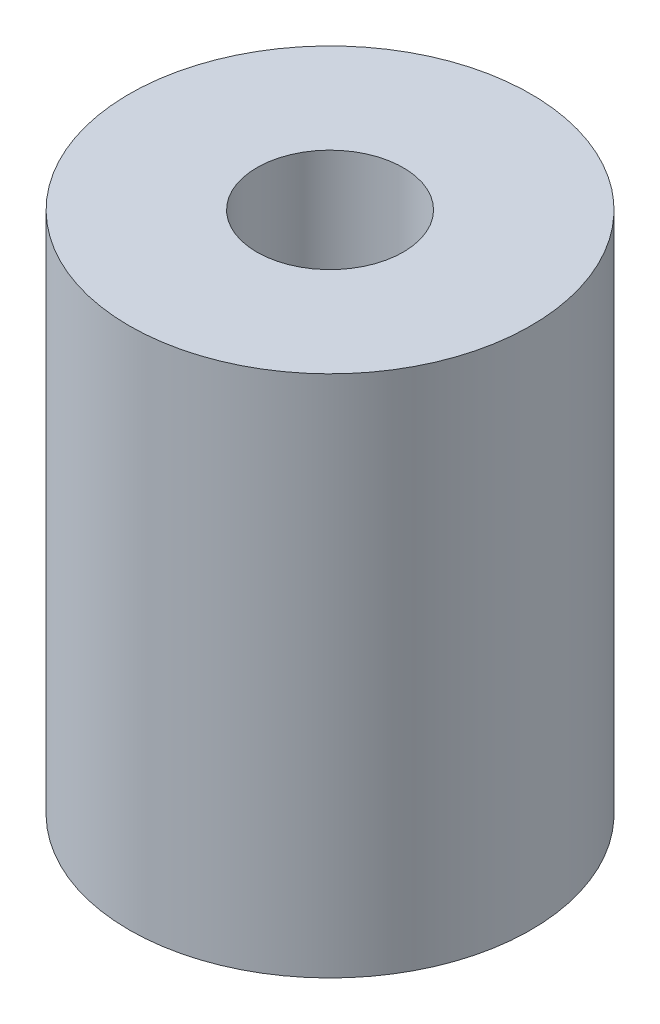
ISO-10303-21;
HEADER;
FILE_DESCRIPTION(('STEP AP214'),'2;1');
FILE_NAME('part.step','',(''),(''),'','','');
FILE_SCHEMA(('AUTOMOTIVE_DESIGN { 1 0 10303 214 1 1 1 1 }'));
ENDSEC;
DATA;
#1=APPLICATION_CONTEXT('core data for automotive mechanical design processes');
#2=APPLICATION_PROTOCOL_DEFINITION('international standard','automotive_design',2000,#1);
#3=PRODUCT_CONTEXT('',#1,'mechanical');
#4=PRODUCT('Part','Part','',(#3));
#5=PRODUCT_RELATED_PRODUCT_CATEGORY('part','',(#4));
#6=PRODUCT_DEFINITION_FORMATION('','',#4);
#7=PRODUCT_DEFINITION_CONTEXT('part definition',#1,'design');
#8=PRODUCT_DEFINITION('design','',#6,#7);
#9=PRODUCT_DEFINITION_SHAPE('','',#8);
#10=(LENGTH_UNIT() NAMED_UNIT(*) SI_UNIT(.MILLI.,.METRE.));
#11=(NAMED_UNIT(*) PLANE_ANGLE_UNIT() SI_UNIT($,.RADIAN.));
#12=(NAMED_UNIT(*) SI_UNIT($,.STERADIAN.) SOLID_ANGLE_UNIT());
#13=UNCERTAINTY_MEASURE_WITH_UNIT(LENGTH_MEASURE(1.E-05),#10,'distance_accuracy_value','');
#14=(GEOMETRIC_REPRESENTATION_CONTEXT(3) GLOBAL_UNCERTAINTY_ASSIGNED_CONTEXT((#13)) GLOBAL_UNIT_ASSIGNED_CONTEXT((#10,
#11,#12)) REPRESENTATION_CONTEXT('',''));
#15=CARTESIAN_POINT('',(0.,0.,0.));
#16=DIRECTION('',(0.,0.,1.));
#17=DIRECTION('',(1.,0.,0.));
#18=AXIS2_PLACEMENT_3D('',#15,#16,#17);
#19=CARTESIAN_POINT('',(0.,28.956,0.));
#20=DIRECTION('',(0.,1.,0.));
#21=DIRECTION('',(0.,0.,1.));
#22=AXIS2_PLACEMENT_3D('',#19,#20,#21);
#23=PLANE('',#22);
#24=CARTESIAN_POINT('',(0.,28.956,0.));
#25=DIRECTION('',(0.,1.,0.));
#26=DIRECTION('',(0.,0.,1.));
#27=AXIS2_PLACEMENT_3D('',#24,#25,#26);
#28=CIRCLE('',#27,11.1125);
#29=CARTESIAN_POINT('',(0.,28.956,11.1125));
#30=VERTEX_POINT('',#29);
#31=EDGE_CURVE('E10',#30,#30,#28,.T.);
#32=ORIENTED_EDGE('',*,*,#31,.T.);
#33=EDGE_LOOP('',(#32));
#34=FACE_BOUND('',#33,.T.);
#35=CARTESIAN_POINT('',(0.,28.956,0.));
#36=DIRECTION('',(0.,1.,0.));
#37=DIRECTION('',(0.,0.,1.));
#38=AXIS2_PLACEMENT_3D('',#35,#36,#37);
#39=CIRCLE('',#38,4.0513);
#40=CARTESIAN_POINT('',(0.,28.956,4.0513));
#41=VERTEX_POINT('',#40);
#42=EDGE_CURVE('E42',#41,#41,#39,.T.);
#43=ORIENTED_EDGE('',*,*,#42,.F.);
#44=EDGE_LOOP('',(#43));
#45=FACE_BOUND('',#44,.T.);
#46=ADVANCED_FACE('F31',(#34,#45),#23,.T.);
#47=CARTESIAN_POINT('',(0.,0.,0.));
#48=DIRECTION('',(0.,1.,0.));
#49=DIRECTION('',(0.,0.,1.));
#50=AXIS2_PLACEMENT_3D('',#47,#48,#49);
#51=PLANE('',#50);
#52=CARTESIAN_POINT('',(0.,0.,0.));
#53=DIRECTION('',(0.,1.,0.));
#54=DIRECTION('',(0.,0.,1.));
#55=AXIS2_PLACEMENT_3D('',#52,#53,#54);
#56=CIRCLE('',#55,11.1125);
#57=CARTESIAN_POINT('',(0.,0.,11.1125));
#58=VERTEX_POINT('',#57);
#59=EDGE_CURVE('E35',#58,#58,#56,.T.);
#60=ORIENTED_EDGE('',*,*,#59,.F.);
#61=EDGE_LOOP('',(#60));
#62=FACE_BOUND('',#61,.T.);
#63=CARTESIAN_POINT('',(0.,0.,0.));
#64=DIRECTION('',(0.,1.,0.));
#65=DIRECTION('',(0.,0.,1.));
#66=AXIS2_PLACEMENT_3D('',#63,#64,#65);
#67=CIRCLE('',#66,4.0513);
#68=CARTESIAN_POINT('',(0.,0.,4.0513));
#69=VERTEX_POINT('',#68);
#70=EDGE_CURVE('E44',#69,#69,#67,.T.);
#71=ORIENTED_EDGE('',*,*,#70,.T.);
#72=EDGE_LOOP('',(#71));
#73=FACE_BOUND('',#72,.T.);
#74=ADVANCED_FACE('F54',(#62,#73),#51,.F.);
#75=CARTESIAN_POINT('',(0.,28.956,0.));
#76=DIRECTION('',(0.,-1.,0.));
#77=DIRECTION('',(0.,0.,-1.));
#78=AXIS2_PLACEMENT_3D('',#75,#76,#77);
#79=CYLINDRICAL_SURFACE('',#78,11.1125);
#80=ORIENTED_EDGE('',*,*,#31,.F.);
#81=EDGE_LOOP('',(#80));
#82=FACE_BOUND('',#81,.T.);
#83=ORIENTED_EDGE('',*,*,#59,.T.);
#84=EDGE_LOOP('',(#83));
#85=FACE_BOUND('',#84,.T.);
#86=ADVANCED_FACE('F33',(#82,#85),#79,.T.);
#87=CARTESIAN_POINT('',(0.,28.956,0.));
#88=DIRECTION('',(0.,-1.,0.));
#89=DIRECTION('',(0.,0.,-1.));
#90=AXIS2_PLACEMENT_3D('',#87,#88,#89);
#91=CYLINDRICAL_SURFACE('',#90,4.0513);
#92=ORIENTED_EDGE('',*,*,#42,.T.);
#93=EDGE_LOOP('',(#92));
#94=FACE_BOUND('',#93,.T.);
#95=ORIENTED_EDGE('',*,*,#70,.F.);
#96=EDGE_LOOP('',(#95));
#97=FACE_BOUND('',#96,.T.);
#98=ADVANCED_FACE('F50',(#94,#97),#91,.F.);
#99=CLOSED_SHELL('',(#46,#74,#86,#98));
#100=MANIFOLD_SOLID_BREP('B2',#99);
#101=ADVANCED_BREP_SHAPE_REPRESENTATION('',(#18,#100),#14);
#102=SHAPE_DEFINITION_REPRESENTATION(#9,#101);
ENDSEC;
END-ISO-10303-21;
